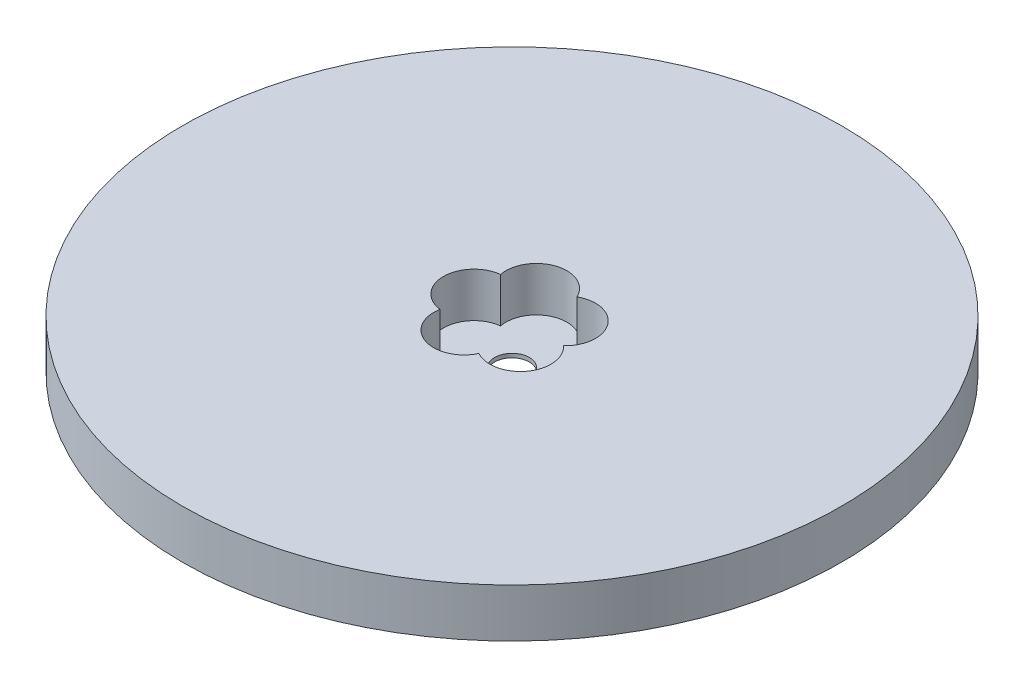
ISO-10303-21;
HEADER;
FILE_DESCRIPTION(('STEP AP214'),'2;1');
FILE_NAME('part.step','',(''),(''),'','','');
FILE_SCHEMA(('AUTOMOTIVE_DESIGN { 1 0 10303 214 1 1 1 1 }'));
ENDSEC;
DATA;
#1=APPLICATION_CONTEXT('core data for automotive mechanical design processes');
#2=APPLICATION_PROTOCOL_DEFINITION('international standard','automotive_design',2000,#1);
#3=PRODUCT_CONTEXT('',#1,'mechanical');
#4=PRODUCT('Part','Part','',(#3));
#5=PRODUCT_RELATED_PRODUCT_CATEGORY('part','',(#4));
#6=PRODUCT_DEFINITION_FORMATION('','',#4);
#7=PRODUCT_DEFINITION_CONTEXT('part definition',#1,'design');
#8=PRODUCT_DEFINITION('design','',#6,#7);
#9=PRODUCT_DEFINITION_SHAPE('','',#8);
#10=(LENGTH_UNIT() NAMED_UNIT(*) SI_UNIT(.MILLI.,.METRE.));
#11=(NAMED_UNIT(*) PLANE_ANGLE_UNIT() SI_UNIT($,.RADIAN.));
#12=(NAMED_UNIT(*) SI_UNIT($,.STERADIAN.) SOLID_ANGLE_UNIT());
#13=UNCERTAINTY_MEASURE_WITH_UNIT(LENGTH_MEASURE(1.E-05),#10,'distance_accuracy_value','');
#14=(GEOMETRIC_REPRESENTATION_CONTEXT(3) GLOBAL_UNCERTAINTY_ASSIGNED_CONTEXT((#13)) GLOBAL_UNIT_ASSIGNED_CONTEXT((#10,
#11,#12)) REPRESENTATION_CONTEXT('',''));
#15=CARTESIAN_POINT('',(0.,0.,0.));
#16=DIRECTION('',(0.,0.,1.));
#17=DIRECTION('',(1.,0.,0.));
#18=AXIS2_PLACEMENT_3D('',#15,#16,#17);
#19=CARTESIAN_POINT('',(0.,14.,0.));
#20=DIRECTION('',(0.,-1.,0.));
#21=DIRECTION('',(0.,0.,-1.));
#22=AXIS2_PLACEMENT_3D('',#19,#20,#21);
#23=CYLINDRICAL_SURFACE('',#22,5.);
#24=CARTESIAN_POINT('',(0.,0.,0.));
#25=DIRECTION('',(0.,1.,0.));
#26=DIRECTION('',(0.,0.,1.));
#27=AXIS2_PLACEMENT_3D('',#24,#25,#26);
#28=CIRCLE('',#27,5.);
#29=CARTESIAN_POINT('',(0.,0.,5.));
#30=VERTEX_POINT('',#29);
#31=EDGE_CURVE('E129',#30,#30,#28,.T.);
#32=ORIENTED_EDGE('',*,*,#31,.F.);
#33=EDGE_LOOP('',(#32));
#34=FACE_BOUND('',#33,.T.);
#35=CARTESIAN_POINT('',(0.,1.14399570700744,0.));
#36=DIRECTION('',(0.,1.,0.));
#37=DIRECTION('',(0.,0.,1.));
#38=AXIS2_PLACEMENT_3D('',#35,#36,#37);
#39=CIRCLE('',#38,5.);
#40=CARTESIAN_POINT('',(0.,1.14399570700744,5.));
#41=VERTEX_POINT('',#40);
#42=EDGE_CURVE('E11',#41,#41,#39,.T.);
#43=ORIENTED_EDGE('',*,*,#42,.T.);
#44=EDGE_LOOP('',(#43));
#45=FACE_BOUND('',#44,.T.);
#46=ADVANCED_FACE('F39',(#34,#45),#23,.F.);
#47=CARTESIAN_POINT('',(0.,14.,0.));
#48=DIRECTION('',(0.,-1.,0.));
#49=DIRECTION('',(0.,0.,-1.));
#50=AXIS2_PLACEMENT_3D('',#47,#48,#49);
#51=CYLINDRICAL_SURFACE('',#50,95.);
#52=CARTESIAN_POINT('',(0.,14.,0.));
#53=DIRECTION('',(0.,1.,0.));
#54=DIRECTION('',(0.,0.,1.));
#55=AXIS2_PLACEMENT_3D('',#52,#53,#54);
#56=CIRCLE('',#55,95.);
#57=CARTESIAN_POINT('',(0.,14.,95.));
#58=VERTEX_POINT('',#57);
#59=EDGE_CURVE('E50',#58,#58,#56,.T.);
#60=ORIENTED_EDGE('',*,*,#59,.F.);
#61=EDGE_LOOP('',(#60));
#62=FACE_BOUND('',#61,.T.);
#63=CARTESIAN_POINT('',(0.,0.,0.));
#64=DIRECTION('',(0.,1.,0.));
#65=DIRECTION('',(0.,0.,1.));
#66=AXIS2_PLACEMENT_3D('',#63,#64,#65);
#67=CIRCLE('',#66,95.);
#68=CARTESIAN_POINT('',(0.,0.,95.));
#69=VERTEX_POINT('',#68);
#70=EDGE_CURVE('E133',#69,#69,#67,.T.);
#71=ORIENTED_EDGE('',*,*,#70,.T.);
#72=EDGE_LOOP('',(#71));
#73=FACE_BOUND('',#72,.T.);
#74=ADVANCED_FACE('F41',(#62,#73),#51,.T.);
#75=CARTESIAN_POINT('',(0.,14.,0.));
#76=DIRECTION('',(0.,1.,0.));
#77=DIRECTION('',(0.,0.,1.));
#78=AXIS2_PLACEMENT_3D('',#75,#76,#77);
#79=PLANE('',#78);
#80=CARTESIAN_POINT('',(-3.38481540786846,14.,10.417390657174));
#81=DIRECTION('',(0.,1.,0.));
#82=DIRECTION('',(0.951056516295155,0.,0.309016994374945));
#83=AXIS2_PLACEMENT_3D('',#80,#81,#82);
#84=CIRCLE('',#83,8.79714621657342);
#85=CARTESIAN_POINT('',(-12.0190780580574,14.,8.73237135659481));
#86=VERTEX_POINT('',#85);
#87=CARTESIAN_POINT('',(4.59087930473991,14.,14.1292736573564));
#88=VERTEX_POINT('',#87);
#89=EDGE_CURVE('E119',#86,#88,#84,.T.);
#90=ORIENTED_EDGE('',*,*,#89,.F.);
#91=CARTESIAN_POINT('',(-10.9534927511511,14.,0.));
#92=DIRECTION('',(0.,1.,0.));
#93=DIRECTION('',(0.,0.,1.));
#94=AXIS2_PLACEMENT_3D('',#91,#92,#93);
#95=CIRCLE('',#94,8.79714621657342);
#96=CARTESIAN_POINT('',(-12.0190780580575,14.,-8.73237135659479));
#97=VERTEX_POINT('',#96);
#98=EDGE_CURVE('E127',#97,#86,#95,.T.);
#99=ORIENTED_EDGE('',*,*,#98,.F.);
#100=CARTESIAN_POINT('',(-3.38481540786861,14.,-10.417390657174));
#101=DIRECTION('',(0.,1.,0.));
#102=DIRECTION('',(-0.95105651629515,0.,0.309016994374958));
#103=AXIS2_PLACEMENT_3D('',#100,#101,#102);
#104=CIRCLE('',#103,8.79714621657342);
#105=CARTESIAN_POINT('',(4.59087930473971,14.,-14.1292736573564));
#106=VERTEX_POINT('',#105);
#107=EDGE_CURVE('E53',#106,#97,#104,.T.);
#108=ORIENTED_EDGE('',*,*,#107,.F.);
#109=CARTESIAN_POINT('',(8.86156178344399,14.,-6.43830150021921));
#110=DIRECTION('',(0.,1.,0.));
#111=DIRECTION('',(-0.58778525229248,0.,-0.809016994374942));
#112=AXIS2_PLACEMENT_3D('',#109,#110,#111);
#113=CIRCLE('',#112,8.79714621657342);
#114=CARTESIAN_POINT('',(14.8563975066351,14.,-1.06685493772574E-13));
#115=VERTEX_POINT('',#114);
#116=EDGE_CURVE('E99',#115,#106,#113,.T.);
#117=ORIENTED_EDGE('',*,*,#116,.F.);
#118=CARTESIAN_POINT('',(8.86156178344409,14.,6.43830150021908));
#119=DIRECTION('',(0.,1.,0.));
#120=DIRECTION('',(0.587785252292469,0.,-0.809016994374951));
#121=AXIS2_PLACEMENT_3D('',#118,#119,#120);
#122=CIRCLE('',#121,8.79714621657342);
#123=EDGE_CURVE('E113',#88,#115,#122,.T.);
#124=ORIENTED_EDGE('',*,*,#123,.F.);
#125=EDGE_LOOP('',(#90,#99,#108,#117,#124));
#126=FACE_BOUND('',#125,.T.);
#127=ORIENTED_EDGE('',*,*,#59,.T.);
#128=EDGE_LOOP('',(#127));
#129=FACE_BOUND('',#128,.T.);
#130=ADVANCED_FACE('F141',(#126,#129),#79,.T.);
#131=CARTESIAN_POINT('',(0.,0.,0.));
#132=DIRECTION('',(0.,1.,0.));
#133=DIRECTION('',(0.,0.,1.));
#134=AXIS2_PLACEMENT_3D('',#131,#132,#133);
#135=PLANE('',#134);
#136=ORIENTED_EDGE('',*,*,#31,.T.);
#137=EDGE_LOOP('',(#136));
#138=FACE_BOUND('',#137,.T.);
#139=ORIENTED_EDGE('',*,*,#70,.F.);
#140=EDGE_LOOP('',(#139));
#141=FACE_BOUND('',#140,.T.);
#142=ADVANCED_FACE('F139',(#138,#141),#135,.F.);
#143=CARTESIAN_POINT('',(-10.9534927511511,1.14399570700744,0.));
#144=DIRECTION('',(0.,1.,0.));
#145=DIRECTION('',(0.,0.,1.));
#146=AXIS2_PLACEMENT_3D('',#143,#144,#145);
#147=CYLINDRICAL_SURFACE('',#146,8.79714621657342);
#148=ORIENTED_EDGE('',*,*,#98,.T.);
#149=DIRECTION('',(0.,1.,0.));
#150=VECTOR('',#149,1.);
#151=CARTESIAN_POINT('',(-12.0190780580574,7.57199785350372,8.73237135659481));
#152=LINE('',#151,#150);
#153=CARTESIAN_POINT('',(-12.0190780580574,1.14399570700744,8.73237135659481));
#154=VERTEX_POINT('',#153);
#155=EDGE_CURVE('E65',#86,#154,#152,.F.);
#156=ORIENTED_EDGE('',*,*,#155,.T.);
#157=CARTESIAN_POINT('',(-10.9534927511511,1.14399570700744,0.));
#158=DIRECTION('',(0.,1.,0.));
#159=DIRECTION('',(0.,0.,1.));
#160=AXIS2_PLACEMENT_3D('',#157,#158,#159);
#161=CIRCLE('',#160,8.79714621657342);
#162=CARTESIAN_POINT('',(-12.0190780580575,1.14399570700744,-8.73237135659479));
#163=VERTEX_POINT('',#162);
#164=EDGE_CURVE('E130',#163,#154,#161,.T.);
#165=ORIENTED_EDGE('',*,*,#164,.F.);
#166=DIRECTION('',(0.,1.,0.));
#167=VECTOR('',#166,1.);
#168=CARTESIAN_POINT('',(-12.0190780580575,7.57199785350372,-8.73237135659479));
#169=LINE('',#168,#167);
#170=EDGE_CURVE('E108',#163,#97,#169,.T.);
#171=ORIENTED_EDGE('',*,*,#170,.T.);
#172=EDGE_LOOP('',(#148,#156,#165,#171));
#173=FACE_BOUND('',#172,.T.);
#174=ADVANCED_FACE('F142',(#173),#147,.F.);
#175=CARTESIAN_POINT('',(-10.9534927511511,1.14399570700744,0.));
#176=DIRECTION('',(0.,1.,0.));
#177=DIRECTION('',(0.,0.,1.));
#178=AXIS2_PLACEMENT_3D('',#175,#176,#177);
#179=PLANE('',#178);
#180=ORIENTED_EDGE('',*,*,#164,.T.);
#181=CARTESIAN_POINT('',(-3.38481540786846,1.14399570700744,10.417390657174));
#182=DIRECTION('',(0.,1.,0.));
#183=DIRECTION('',(0.951056516295155,0.,0.309016994374945));
#184=AXIS2_PLACEMENT_3D('',#181,#182,#183);
#185=CIRCLE('',#184,8.79714621657342);
#186=CARTESIAN_POINT('',(4.59087930473991,1.14399570700744,14.1292736573564));
#187=VERTEX_POINT('',#186);
#188=EDGE_CURVE('E121',#154,#187,#185,.T.);
#189=ORIENTED_EDGE('',*,*,#188,.T.);
#190=CARTESIAN_POINT('',(8.86156178344409,1.14399570700744,6.43830150021908));
#191=DIRECTION('',(0.,1.,0.));
#192=DIRECTION('',(0.587785252292469,0.,-0.809016994374951));
#193=AXIS2_PLACEMENT_3D('',#190,#191,#192);
#194=CIRCLE('',#193,8.79714621657342);
#195=CARTESIAN_POINT('',(14.8563975066351,1.14399570700744,-1.06685493772574E-13));
#196=VERTEX_POINT('',#195);
#197=EDGE_CURVE('E92',#187,#196,#194,.T.);
#198=ORIENTED_EDGE('',*,*,#197,.T.);
#199=CARTESIAN_POINT('',(8.86156178344399,1.14399570700744,-6.43830150021921));
#200=DIRECTION('',(0.,1.,0.));
#201=DIRECTION('',(-0.58778525229248,0.,-0.809016994374942));
#202=AXIS2_PLACEMENT_3D('',#199,#200,#201);
#203=CIRCLE('',#202,8.79714621657342);
#204=CARTESIAN_POINT('',(4.5908793047397,1.14399570700744,-14.1292736573564));
#205=VERTEX_POINT('',#204);
#206=EDGE_CURVE('E88',#196,#205,#203,.T.);
#207=ORIENTED_EDGE('',*,*,#206,.T.);
#208=CARTESIAN_POINT('',(-3.38481540786861,1.14399570700744,-10.417390657174));
#209=DIRECTION('',(0.,1.,0.));
#210=DIRECTION('',(-0.95105651629515,0.,0.309016994374958));
#211=AXIS2_PLACEMENT_3D('',#208,#209,#210);
#212=CIRCLE('',#211,8.79714621657342);
#213=EDGE_CURVE('E95',#205,#163,#212,.T.);
#214=ORIENTED_EDGE('',*,*,#213,.T.);
#215=EDGE_LOOP('',(#180,#189,#198,#207,#214));
#216=FACE_BOUND('',#215,.T.);
#217=ORIENTED_EDGE('',*,*,#42,.F.);
#218=EDGE_LOOP('',(#217));
#219=FACE_BOUND('',#218,.T.);
#220=ADVANCED_FACE('F90',(#216,#219),#179,.T.);
#221=CARTESIAN_POINT('',(-3.38481540786846,1.14399570700744,10.417390657174));
#222=DIRECTION('',(0.,1.,0.));
#223=DIRECTION('',(0.,0.,1.));
#224=AXIS2_PLACEMENT_3D('',#221,#222,#223);
#225=CYLINDRICAL_SURFACE('',#224,8.79714621657342);
#226=ORIENTED_EDGE('',*,*,#89,.T.);
#227=DIRECTION('',(0.,1.,0.));
#228=VECTOR('',#227,1.);
#229=CARTESIAN_POINT('',(4.59087930473991,7.57199785350372,14.1292736573564));
#230=LINE('',#229,#228);
#231=EDGE_CURVE('E106',#88,#187,#230,.F.);
#232=ORIENTED_EDGE('',*,*,#231,.T.);
#233=ORIENTED_EDGE('',*,*,#188,.F.);
#234=ORIENTED_EDGE('',*,*,#155,.F.);
#235=EDGE_LOOP('',(#226,#232,#233,#234));
#236=FACE_BOUND('',#235,.T.);
#237=ADVANCED_FACE('F164',(#236),#225,.F.);
#238=CARTESIAN_POINT('',(-3.38481540786861,1.14399570700744,-10.417390657174));
#239=DIRECTION('',(0.,1.,0.));
#240=DIRECTION('',(0.,0.,1.));
#241=AXIS2_PLACEMENT_3D('',#238,#239,#240);
#242=CYLINDRICAL_SURFACE('',#241,8.79714621657342);
#243=ORIENTED_EDGE('',*,*,#213,.F.);
#244=DIRECTION('',(0.,1.,0.));
#245=VECTOR('',#244,1.);
#246=CARTESIAN_POINT('',(4.5908793047397,7.57199785350372,-14.1292736573564));
#247=LINE('',#246,#245);
#248=EDGE_CURVE('E103',#106,#205,#247,.F.);
#249=ORIENTED_EDGE('',*,*,#248,.F.);
#250=ORIENTED_EDGE('',*,*,#107,.T.);
#251=ORIENTED_EDGE('',*,*,#170,.F.);
#252=EDGE_LOOP('',(#243,#249,#250,#251));
#253=FACE_BOUND('',#252,.T.);
#254=ADVANCED_FACE('F107',(#253),#242,.F.);
#255=CARTESIAN_POINT('',(8.86156178344409,1.14399570700744,6.43830150021908));
#256=DIRECTION('',(0.,1.,0.));
#257=DIRECTION('',(0.,0.,1.));
#258=AXIS2_PLACEMENT_3D('',#255,#256,#257);
#259=CYLINDRICAL_SURFACE('',#258,8.79714621657342);
#260=ORIENTED_EDGE('',*,*,#123,.T.);
#261=DIRECTION('',(0.,1.,0.));
#262=VECTOR('',#261,1.);
#263=CARTESIAN_POINT('',(14.8563975066351,7.57199785350372,-1.06685493772574E-13));
#264=LINE('',#263,#262);
#265=EDGE_CURVE('E97',#115,#196,#264,.F.);
#266=ORIENTED_EDGE('',*,*,#265,.T.);
#267=ORIENTED_EDGE('',*,*,#197,.F.);
#268=ORIENTED_EDGE('',*,*,#231,.F.);
#269=EDGE_LOOP('',(#260,#266,#267,#268));
#270=FACE_BOUND('',#269,.T.);
#271=ADVANCED_FACE('F169',(#270),#259,.F.);
#272=CARTESIAN_POINT('',(8.86156178344399,1.14399570700744,-6.43830150021921));
#273=DIRECTION('',(0.,1.,0.));
#274=DIRECTION('',(0.,0.,1.));
#275=AXIS2_PLACEMENT_3D('',#272,#273,#274);
#276=CYLINDRICAL_SURFACE('',#275,8.79714621657342);
#277=ORIENTED_EDGE('',*,*,#248,.T.);
#278=ORIENTED_EDGE('',*,*,#206,.F.);
#279=ORIENTED_EDGE('',*,*,#265,.F.);
#280=ORIENTED_EDGE('',*,*,#116,.T.);
#281=EDGE_LOOP('',(#277,#278,#279,#280));
#282=FACE_BOUND('',#281,.T.);
#283=ADVANCED_FACE('F102',(#282),#276,.F.);
#284=CLOSED_SHELL('',(#46,#74,#130,#142,#174,#220,#237,#254,#271,#283));
#285=MANIFOLD_SOLID_BREP('B2',#284);
#286=ADVANCED_BREP_SHAPE_REPRESENTATION('',(#18,#285),#14);
#287=SHAPE_DEFINITION_REPRESENTATION(#9,#286);
ENDSEC;
END-ISO-10303-21;
